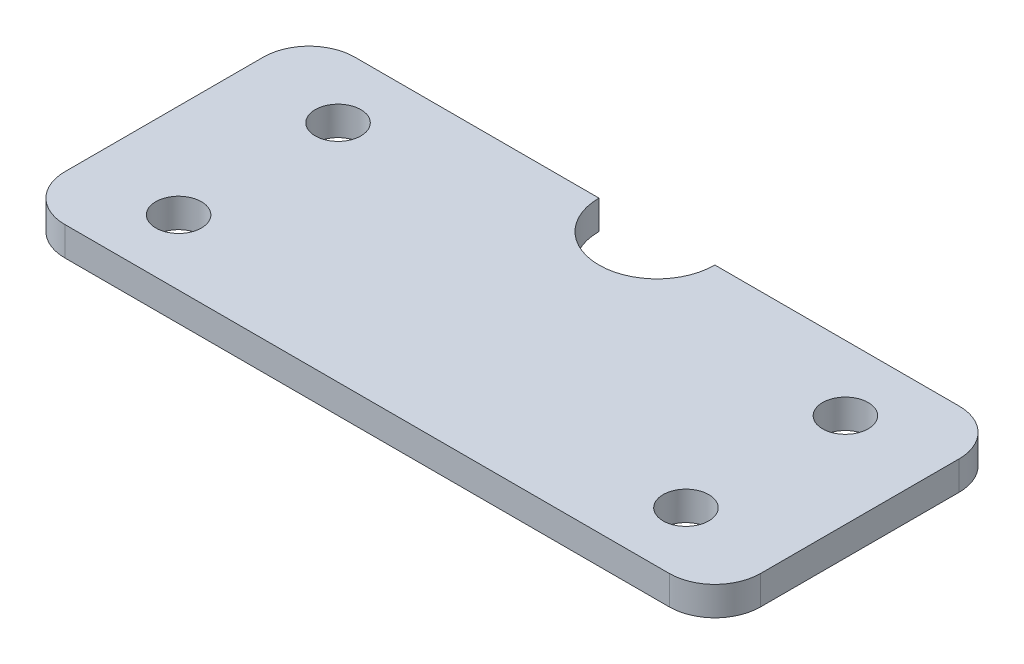
ISO-10303-21;
HEADER;
FILE_DESCRIPTION(('STEP AP214'),'2;1');
FILE_NAME('part.step','',(''),(''),'','','');
FILE_SCHEMA(('AUTOMOTIVE_DESIGN { 1 0 10303 214 1 1 1 1 }'));
ENDSEC;
DATA;
#1=APPLICATION_CONTEXT('core data for automotive mechanical design processes');
#2=APPLICATION_PROTOCOL_DEFINITION('international standard','automotive_design',2000,#1);
#3=PRODUCT_CONTEXT('',#1,'mechanical');
#4=PRODUCT('Part','Part','',(#3));
#5=PRODUCT_RELATED_PRODUCT_CATEGORY('part','',(#4));
#6=PRODUCT_DEFINITION_FORMATION('','',#4);
#7=PRODUCT_DEFINITION_CONTEXT('part definition',#1,'design');
#8=PRODUCT_DEFINITION('design','',#6,#7);
#9=PRODUCT_DEFINITION_SHAPE('','',#8);
#10=(LENGTH_UNIT() NAMED_UNIT(*) SI_UNIT(.MILLI.,.METRE.));
#11=(NAMED_UNIT(*) PLANE_ANGLE_UNIT() SI_UNIT($,.RADIAN.));
#12=(NAMED_UNIT(*) SI_UNIT($,.STERADIAN.) SOLID_ANGLE_UNIT());
#13=UNCERTAINTY_MEASURE_WITH_UNIT(LENGTH_MEASURE(1.E-05),#10,'distance_accuracy_value','');
#14=(GEOMETRIC_REPRESENTATION_CONTEXT(3) GLOBAL_UNCERTAINTY_ASSIGNED_CONTEXT((#13)) GLOBAL_UNIT_ASSIGNED_CONTEXT((#10,
#11,#12)) REPRESENTATION_CONTEXT('',''));
#15=CARTESIAN_POINT('',(0.,0.,0.));
#16=DIRECTION('',(0.,0.,1.));
#17=DIRECTION('',(1.,0.,0.));
#18=AXIS2_PLACEMENT_3D('',#15,#16,#17);
#19=CARTESIAN_POINT('',(-76.2,6.35,-31.75));
#20=DIRECTION('',(0.,0.,1.));
#21=DIRECTION('',(1.,0.,0.));
#22=AXIS2_PLACEMENT_3D('',#19,#20,#21);
#23=PLANE('',#22);
#24=DIRECTION('',(-1.,0.,0.));
#25=VECTOR('',#24,1.);
#26=CARTESIAN_POINT('',(-76.2,0.,-31.75));
#27=LINE('',#26,#25);
#28=CARTESIAN_POINT('',(66.2,0.,-31.75));
#29=VERTEX_POINT('',#28);
#30=CARTESIAN_POINT('',(12.6999999999999,0.,-31.75));
#31=VERTEX_POINT('',#30);
#32=EDGE_CURVE('E140',#29,#31,#27,.T.);
#33=ORIENTED_EDGE('',*,*,#32,.T.);
#34=DIRECTION('',(0.,1.,0.));
#35=VECTOR('',#34,1.);
#36=CARTESIAN_POINT('',(12.7,0.,-31.75));
#37=LINE('',#36,#35);
#38=CARTESIAN_POINT('',(12.7,6.35,-31.75));
#39=VERTEX_POINT('',#38);
#40=EDGE_CURVE('E57',#31,#39,#37,.T.);
#41=ORIENTED_EDGE('',*,*,#40,.T.);
#42=DIRECTION('',(-1.,0.,0.));
#43=VECTOR('',#42,1.);
#44=CARTESIAN_POINT('',(-76.2,6.35,-31.75));
#45=LINE('',#44,#43);
#46=CARTESIAN_POINT('',(66.2,6.35,-31.75));
#47=VERTEX_POINT('',#46);
#48=EDGE_CURVE('E230',#47,#39,#45,.T.);
#49=ORIENTED_EDGE('',*,*,#48,.F.);
#50=DIRECTION('',(0.,-1.,0.));
#51=VECTOR('',#50,1.);
#52=CARTESIAN_POINT('',(66.2,6.35,-31.75));
#53=LINE('',#52,#51);
#54=EDGE_CURVE('E11',#47,#29,#53,.T.);
#55=ORIENTED_EDGE('',*,*,#54,.T.);
#56=EDGE_LOOP('',(#33,#41,#49,#55));
#57=FACE_BOUND('',#56,.T.);
#58=ADVANCED_FACE('F39',(#57),#23,.F.);
#59=CARTESIAN_POINT('',(76.2,6.35,31.75));
#60=DIRECTION('',(-1.,0.,0.));
#61=DIRECTION('',(0.,0.,1.));
#62=AXIS2_PLACEMENT_3D('',#59,#60,#61);
#63=PLANE('',#62);
#64=DIRECTION('',(0.,0.,-1.));
#65=VECTOR('',#64,1.);
#66=CARTESIAN_POINT('',(76.2,6.35,31.75));
#67=LINE('',#66,#65);
#68=CARTESIAN_POINT('',(76.2,6.35,21.75));
#69=VERTEX_POINT('',#68);
#70=CARTESIAN_POINT('',(76.2,6.35,-21.75));
#71=VERTEX_POINT('',#70);
#72=EDGE_CURVE('E156',#69,#71,#67,.T.);
#73=ORIENTED_EDGE('',*,*,#72,.F.);
#74=DIRECTION('',(0.,-1.,0.));
#75=VECTOR('',#74,1.);
#76=CARTESIAN_POINT('',(76.2,6.35,21.75));
#77=LINE('',#76,#75);
#78=CARTESIAN_POINT('',(76.2,0.,21.75));
#79=VERTEX_POINT('',#78);
#80=EDGE_CURVE('E198',#69,#79,#77,.T.);
#81=ORIENTED_EDGE('',*,*,#80,.T.);
#82=DIRECTION('',(0.,0.,-1.));
#83=VECTOR('',#82,1.);
#84=CARTESIAN_POINT('',(76.2,0.,31.75));
#85=LINE('',#84,#83);
#86=CARTESIAN_POINT('',(76.2,0.,-21.75));
#87=VERTEX_POINT('',#86);
#88=EDGE_CURVE('E133',#79,#87,#85,.T.);
#89=ORIENTED_EDGE('',*,*,#88,.T.);
#90=DIRECTION('',(0.,-1.,0.));
#91=VECTOR('',#90,1.);
#92=CARTESIAN_POINT('',(76.2,6.35,-21.75));
#93=LINE('',#92,#91);
#94=EDGE_CURVE('E195',#87,#71,#93,.F.);
#95=ORIENTED_EDGE('',*,*,#94,.T.);
#96=EDGE_LOOP('',(#73,#81,#89,#95));
#97=FACE_BOUND('',#96,.T.);
#98=ADVANCED_FACE('F252',(#97),#63,.F.);
#99=CARTESIAN_POINT('',(-12.7,6.35,-31.75));
#100=VERTEX_POINT('',#99);
#101=CARTESIAN_POINT('',(-66.2,6.35,-31.75));
#102=VERTEX_POINT('',#101);
#103=EDGE_CURVE('E65',#100,#102,#45,.T.);
#104=ORIENTED_EDGE('',*,*,#103,.F.);
#105=DIRECTION('',(0.,1.,0.));
#106=VECTOR('',#105,1.);
#107=CARTESIAN_POINT('',(-12.7,0.,-31.75));
#108=LINE('',#107,#106);
#109=CARTESIAN_POINT('',(-12.7,0.,-31.75));
#110=VERTEX_POINT('',#109);
#111=EDGE_CURVE('E120',#110,#100,#108,.T.);
#112=ORIENTED_EDGE('',*,*,#111,.F.);
#113=CARTESIAN_POINT('',(-66.2,0.,-31.75));
#114=VERTEX_POINT('',#113);
#115=EDGE_CURVE('E130',#110,#114,#27,.T.);
#116=ORIENTED_EDGE('',*,*,#115,.T.);
#117=DIRECTION('',(0.,-1.,0.));
#118=VECTOR('',#117,1.);
#119=CARTESIAN_POINT('',(-66.2,6.35,-31.75));
#120=LINE('',#119,#118);
#121=EDGE_CURVE('E49',#114,#102,#120,.F.);
#122=ORIENTED_EDGE('',*,*,#121,.T.);
#123=EDGE_LOOP('',(#104,#112,#116,#122));
#124=FACE_BOUND('',#123,.T.);
#125=ADVANCED_FACE('F129',(#124),#23,.F.);
#126=CARTESIAN_POINT('',(-76.2,6.35,31.75));
#127=DIRECTION('',(1.,0.,0.));
#128=DIRECTION('',(0.,0.,-1.));
#129=AXIS2_PLACEMENT_3D('',#126,#127,#128);
#130=PLANE('',#129);
#131=DIRECTION('',(0.,0.,1.));
#132=VECTOR('',#131,1.);
#133=CARTESIAN_POINT('',(-76.2,0.,31.75));
#134=LINE('',#133,#132);
#135=CARTESIAN_POINT('',(-76.2,0.,-21.75));
#136=VERTEX_POINT('',#135);
#137=CARTESIAN_POINT('',(-76.2,0.,21.75));
#138=VERTEX_POINT('',#137);
#139=EDGE_CURVE('E144',#136,#138,#134,.T.);
#140=ORIENTED_EDGE('',*,*,#139,.T.);
#141=DIRECTION('',(0.,-1.,0.));
#142=VECTOR('',#141,1.);
#143=CARTESIAN_POINT('',(-76.2,6.35,21.75));
#144=LINE('',#143,#142);
#145=CARTESIAN_POINT('',(-76.2,6.35,21.75));
#146=VERTEX_POINT('',#145);
#147=EDGE_CURVE('E180',#138,#146,#144,.F.);
#148=ORIENTED_EDGE('',*,*,#147,.T.);
#149=DIRECTION('',(0.,0.,1.));
#150=VECTOR('',#149,1.);
#151=CARTESIAN_POINT('',(-76.2,6.35,31.75));
#152=LINE('',#151,#150);
#153=CARTESIAN_POINT('',(-76.2,6.35,-21.75));
#154=VERTEX_POINT('',#153);
#155=EDGE_CURVE('E234',#154,#146,#152,.T.);
#156=ORIENTED_EDGE('',*,*,#155,.F.);
#157=DIRECTION('',(0.,-1.,0.));
#158=VECTOR('',#157,1.);
#159=CARTESIAN_POINT('',(-76.2,6.35,-21.75));
#160=LINE('',#159,#158);
#161=EDGE_CURVE('E176',#154,#136,#160,.T.);
#162=ORIENTED_EDGE('',*,*,#161,.T.);
#163=EDGE_LOOP('',(#140,#148,#156,#162));
#164=FACE_BOUND('',#163,.T.);
#165=ADVANCED_FACE('F269',(#164),#130,.F.);
#166=CARTESIAN_POINT('',(-76.2,6.35,31.75));
#167=DIRECTION('',(0.,0.,-1.));
#168=DIRECTION('',(-1.,0.,0.));
#169=AXIS2_PLACEMENT_3D('',#166,#167,#168);
#170=PLANE('',#169);
#171=DIRECTION('',(1.,0.,0.));
#172=VECTOR('',#171,1.);
#173=CARTESIAN_POINT('',(-76.2,6.35,31.75));
#174=LINE('',#173,#172);
#175=CARTESIAN_POINT('',(-66.2,6.35,31.75));
#176=VERTEX_POINT('',#175);
#177=CARTESIAN_POINT('',(66.2,6.35,31.75));
#178=VERTEX_POINT('',#177);
#179=EDGE_CURVE('E161',#176,#178,#174,.T.);
#180=ORIENTED_EDGE('',*,*,#179,.F.);
#181=DIRECTION('',(0.,-1.,0.));
#182=VECTOR('',#181,1.);
#183=CARTESIAN_POINT('',(-66.2,6.35,31.75));
#184=LINE('',#183,#182);
#185=CARTESIAN_POINT('',(-66.2,0.,31.75));
#186=VERTEX_POINT('',#185);
#187=EDGE_CURVE('E160',#176,#186,#184,.T.);
#188=ORIENTED_EDGE('',*,*,#187,.T.);
#189=DIRECTION('',(1.,0.,0.));
#190=VECTOR('',#189,1.);
#191=CARTESIAN_POINT('',(-76.2,0.,31.75));
#192=LINE('',#191,#190);
#193=CARTESIAN_POINT('',(66.2,0.,31.75));
#194=VERTEX_POINT('',#193);
#195=EDGE_CURVE('E152',#186,#194,#192,.T.);
#196=ORIENTED_EDGE('',*,*,#195,.T.);
#197=DIRECTION('',(0.,-1.,0.));
#198=VECTOR('',#197,1.);
#199=CARTESIAN_POINT('',(66.2,6.35,31.75));
#200=LINE('',#199,#198);
#201=EDGE_CURVE('E157',#194,#178,#200,.F.);
#202=ORIENTED_EDGE('',*,*,#201,.T.);
#203=EDGE_LOOP('',(#180,#188,#196,#202));
#204=FACE_BOUND('',#203,.T.);
#205=ADVANCED_FACE('F273',(#204),#170,.F.);
#206=CARTESIAN_POINT('',(0.,6.35,0.));
#207=DIRECTION('',(0.,-1.,0.));
#208=DIRECTION('',(0.,0.,-1.));
#209=AXIS2_PLACEMENT_3D('',#206,#207,#208);
#210=PLANE('',#209);
#211=CARTESIAN_POINT('',(-55.5625,6.35,17.4625));
#212=DIRECTION('',(0.,1.,0.));
#213=DIRECTION('',(0.,0.,-1.));
#214=AXIS2_PLACEMENT_3D('',#211,#212,#213);
#215=CIRCLE('',#214,5.);
#216=CARTESIAN_POINT('',(-55.5625,6.35,12.4625));
#217=VERTEX_POINT('',#216);
#218=EDGE_CURVE('E317',#217,#217,#215,.T.);
#219=ORIENTED_EDGE('',*,*,#218,.F.);
#220=EDGE_LOOP('',(#219));
#221=FACE_BOUND('',#220,.T.);
#222=CARTESIAN_POINT('',(55.5625,6.35,17.4625));
#223=DIRECTION('',(0.,1.,0.));
#224=DIRECTION('',(0.,0.,1.));
#225=AXIS2_PLACEMENT_3D('',#222,#223,#224);
#226=CIRCLE('',#225,5.);
#227=CARTESIAN_POINT('',(55.5625,6.35,22.4625));
#228=VERTEX_POINT('',#227);
#229=EDGE_CURVE('E311',#228,#228,#226,.T.);
#230=ORIENTED_EDGE('',*,*,#229,.F.);
#231=EDGE_LOOP('',(#230));
#232=FACE_BOUND('',#231,.T.);
#233=CARTESIAN_POINT('',(55.5625,6.35,-17.4625));
#234=DIRECTION('',(0.,1.,0.));
#235=DIRECTION('',(0.,0.,-1.));
#236=AXIS2_PLACEMENT_3D('',#233,#234,#235);
#237=CIRCLE('',#236,5.);
#238=CARTESIAN_POINT('',(55.5625,6.35,-22.4625));
#239=VERTEX_POINT('',#238);
#240=EDGE_CURVE('E308',#239,#239,#237,.T.);
#241=ORIENTED_EDGE('',*,*,#240,.F.);
#242=EDGE_LOOP('',(#241));
#243=FACE_BOUND('',#242,.T.);
#244=CARTESIAN_POINT('',(-55.5625,6.35,-17.4625));
#245=DIRECTION('',(0.,1.,0.));
#246=DIRECTION('',(0.,0.,1.));
#247=AXIS2_PLACEMENT_3D('',#244,#245,#246);
#248=CIRCLE('',#247,5.);
#249=CARTESIAN_POINT('',(-55.5625,6.35,-12.4625));
#250=VERTEX_POINT('',#249);
#251=EDGE_CURVE('E209',#250,#250,#248,.T.);
#252=ORIENTED_EDGE('',*,*,#251,.F.);
#253=EDGE_LOOP('',(#252));
#254=FACE_BOUND('',#253,.T.);
#255=ORIENTED_EDGE('',*,*,#48,.T.);
#256=CARTESIAN_POINT('',(0.,6.35,-31.75));
#257=DIRECTION('',(0.,1.,0.));
#258=DIRECTION('',(0.,0.,-1.));
#259=AXIS2_PLACEMENT_3D('',#256,#257,#258);
#260=CIRCLE('',#259,12.7);
#261=EDGE_CURVE('E126',#100,#39,#260,.T.);
#262=ORIENTED_EDGE('',*,*,#261,.F.);
#263=ORIENTED_EDGE('',*,*,#103,.T.);
#264=CARTESIAN_POINT('',(-66.2,6.35,-21.75));
#265=DIRECTION('',(0.,-1.,0.));
#266=DIRECTION('',(0.,0.,-1.));
#267=AXIS2_PLACEMENT_3D('',#264,#265,#266);
#268=CIRCLE('',#267,10.);
#269=EDGE_CURVE('E183',#102,#154,#268,.F.);
#270=ORIENTED_EDGE('',*,*,#269,.T.);
#271=ORIENTED_EDGE('',*,*,#155,.T.);
#272=CARTESIAN_POINT('',(-66.2,6.35,21.75));
#273=DIRECTION('',(0.,-1.,0.));
#274=DIRECTION('',(0.,0.,-1.));
#275=AXIS2_PLACEMENT_3D('',#272,#273,#274);
#276=CIRCLE('',#275,10.);
#277=EDGE_CURVE('E192',#146,#176,#276,.F.);
#278=ORIENTED_EDGE('',*,*,#277,.T.);
#279=ORIENTED_EDGE('',*,*,#179,.T.);
#280=CARTESIAN_POINT('',(66.2,6.35,21.75));
#281=DIRECTION('',(0.,-1.,0.));
#282=DIRECTION('',(0.,0.,-1.));
#283=AXIS2_PLACEMENT_3D('',#280,#281,#282);
#284=CIRCLE('',#283,10.);
#285=EDGE_CURVE('E189',#178,#69,#284,.F.);
#286=ORIENTED_EDGE('',*,*,#285,.T.);
#287=ORIENTED_EDGE('',*,*,#72,.T.);
#288=CARTESIAN_POINT('',(66.2,6.35,-21.75));
#289=DIRECTION('',(0.,-1.,0.));
#290=DIRECTION('',(0.,0.,-1.));
#291=AXIS2_PLACEMENT_3D('',#288,#289,#290);
#292=CIRCLE('',#291,10.);
#293=EDGE_CURVE('E186',#71,#47,#292,.F.);
#294=ORIENTED_EDGE('',*,*,#293,.T.);
#295=EDGE_LOOP('',(#255,#262,#263,#270,#271,#278,#279,#286,#287,#294));
#296=FACE_BOUND('',#295,.T.);
#297=ADVANCED_FACE('F241',(#221,#232,#243,#254,#296),#210,.F.);
#298=CARTESIAN_POINT('',(0.,0.,0.));
#299=DIRECTION('',(0.,-1.,0.));
#300=DIRECTION('',(0.,0.,-1.));
#301=AXIS2_PLACEMENT_3D('',#298,#299,#300);
#302=PLANE('',#301);
#303=CARTESIAN_POINT('',(-55.5625,0.,17.4625));
#304=DIRECTION('',(0.,-1.,0.));
#305=DIRECTION('',(0.,0.,-1.));
#306=AXIS2_PLACEMENT_3D('',#303,#304,#305);
#307=CIRCLE('',#306,5.);
#308=CARTESIAN_POINT('',(-55.5625,0.,12.4625));
#309=VERTEX_POINT('',#308);
#310=EDGE_CURVE('E43',#309,#309,#307,.T.);
#311=ORIENTED_EDGE('',*,*,#310,.F.);
#312=EDGE_LOOP('',(#311));
#313=FACE_BOUND('',#312,.T.);
#314=CARTESIAN_POINT('',(55.5625,0.,17.4625));
#315=DIRECTION('',(0.,-1.,0.));
#316=DIRECTION('',(0.,0.,-1.));
#317=AXIS2_PLACEMENT_3D('',#314,#315,#316);
#318=CIRCLE('',#317,5.);
#319=CARTESIAN_POINT('',(55.5625,0.,12.4625));
#320=VERTEX_POINT('',#319);
#321=EDGE_CURVE('E212',#320,#320,#318,.T.);
#322=ORIENTED_EDGE('',*,*,#321,.F.);
#323=EDGE_LOOP('',(#322));
#324=FACE_BOUND('',#323,.T.);
#325=CARTESIAN_POINT('',(55.5625,0.,-17.4625));
#326=DIRECTION('',(0.,-1.,0.));
#327=DIRECTION('',(0.,0.,-1.));
#328=AXIS2_PLACEMENT_3D('',#325,#326,#327);
#329=CIRCLE('',#328,5.);
#330=CARTESIAN_POINT('',(55.5625,0.,-22.4625));
#331=VERTEX_POINT('',#330);
#332=EDGE_CURVE('E208',#331,#331,#329,.T.);
#333=ORIENTED_EDGE('',*,*,#332,.F.);
#334=EDGE_LOOP('',(#333));
#335=FACE_BOUND('',#334,.T.);
#336=CARTESIAN_POINT('',(-55.5625,0.,-17.4625));
#337=DIRECTION('',(0.,-1.,0.));
#338=DIRECTION('',(0.,0.,-1.));
#339=AXIS2_PLACEMENT_3D('',#336,#337,#338);
#340=CIRCLE('',#339,5.);
#341=CARTESIAN_POINT('',(-55.5625,0.,-22.4625));
#342=VERTEX_POINT('',#341);
#343=EDGE_CURVE('E204',#342,#342,#340,.T.);
#344=ORIENTED_EDGE('',*,*,#343,.F.);
#345=EDGE_LOOP('',(#344));
#346=FACE_BOUND('',#345,.T.);
#347=CARTESIAN_POINT('',(0.,0.,-31.75));
#348=DIRECTION('',(0.,1.,0.));
#349=DIRECTION('',(0.,0.,-1.));
#350=AXIS2_PLACEMENT_3D('',#347,#348,#349);
#351=CIRCLE('',#350,12.7);
#352=EDGE_CURVE('E117',#110,#31,#351,.T.);
#353=ORIENTED_EDGE('',*,*,#352,.T.);
#354=ORIENTED_EDGE('',*,*,#32,.F.);
#355=CARTESIAN_POINT('',(66.2,0.,-21.75));
#356=DIRECTION('',(0.,-1.,0.));
#357=DIRECTION('',(0.,0.,-1.));
#358=AXIS2_PLACEMENT_3D('',#355,#356,#357);
#359=CIRCLE('',#358,10.);
#360=EDGE_CURVE('E167',#29,#87,#359,.T.);
#361=ORIENTED_EDGE('',*,*,#360,.T.);
#362=ORIENTED_EDGE('',*,*,#88,.F.);
#363=CARTESIAN_POINT('',(66.2,0.,21.75));
#364=DIRECTION('',(0.,-1.,0.));
#365=DIRECTION('',(0.,0.,-1.));
#366=AXIS2_PLACEMENT_3D('',#363,#364,#365);
#367=CIRCLE('',#366,10.);
#368=EDGE_CURVE('E170',#79,#194,#367,.T.);
#369=ORIENTED_EDGE('',*,*,#368,.T.);
#370=ORIENTED_EDGE('',*,*,#195,.F.);
#371=CARTESIAN_POINT('',(-66.2,0.,21.75));
#372=DIRECTION('',(0.,-1.,0.));
#373=DIRECTION('',(0.,0.,-1.));
#374=AXIS2_PLACEMENT_3D('',#371,#372,#373);
#375=CIRCLE('',#374,10.);
#376=EDGE_CURVE('E173',#186,#138,#375,.T.);
#377=ORIENTED_EDGE('',*,*,#376,.T.);
#378=ORIENTED_EDGE('',*,*,#139,.F.);
#379=CARTESIAN_POINT('',(-66.2,0.,-21.75));
#380=DIRECTION('',(0.,-1.,0.));
#381=DIRECTION('',(0.,0.,-1.));
#382=AXIS2_PLACEMENT_3D('',#379,#380,#381);
#383=CIRCLE('',#382,10.);
#384=EDGE_CURVE('E137',#136,#114,#383,.T.);
#385=ORIENTED_EDGE('',*,*,#384,.T.);
#386=ORIENTED_EDGE('',*,*,#115,.F.);
#387=EDGE_LOOP('',(#353,#354,#361,#362,#369,#370,#377,#378,#385,#386));
#388=FACE_BOUND('',#387,.T.);
#389=ADVANCED_FACE('F135',(#313,#324,#335,#346,#388),#302,.T.);
#390=CARTESIAN_POINT('',(-66.2,6.35,21.75));
#391=DIRECTION('',(0.,-1.,0.));
#392=DIRECTION('',(0.,0.,-1.));
#393=AXIS2_PLACEMENT_3D('',#390,#391,#392);
#394=CYLINDRICAL_SURFACE('',#393,10.);
#395=ORIENTED_EDGE('',*,*,#277,.F.);
#396=ORIENTED_EDGE('',*,*,#147,.F.);
#397=ORIENTED_EDGE('',*,*,#376,.F.);
#398=ORIENTED_EDGE('',*,*,#187,.F.);
#399=EDGE_LOOP('',(#395,#396,#397,#398));
#400=FACE_BOUND('',#399,.T.);
#401=ADVANCED_FACE('F282',(#400),#394,.T.);
#402=CARTESIAN_POINT('',(66.2,6.35,21.75));
#403=DIRECTION('',(0.,-1.,0.));
#404=DIRECTION('',(0.,0.,-1.));
#405=AXIS2_PLACEMENT_3D('',#402,#403,#404);
#406=CYLINDRICAL_SURFACE('',#405,10.);
#407=ORIENTED_EDGE('',*,*,#285,.F.);
#408=ORIENTED_EDGE('',*,*,#201,.F.);
#409=ORIENTED_EDGE('',*,*,#368,.F.);
#410=ORIENTED_EDGE('',*,*,#80,.F.);
#411=EDGE_LOOP('',(#407,#408,#409,#410));
#412=FACE_BOUND('',#411,.T.);
#413=ADVANCED_FACE('F249',(#412),#406,.T.);
#414=CARTESIAN_POINT('',(66.2,6.35,-21.75));
#415=DIRECTION('',(0.,-1.,0.));
#416=DIRECTION('',(0.,0.,-1.));
#417=AXIS2_PLACEMENT_3D('',#414,#415,#416);
#418=CYLINDRICAL_SURFACE('',#417,10.);
#419=ORIENTED_EDGE('',*,*,#293,.F.);
#420=ORIENTED_EDGE('',*,*,#94,.F.);
#421=ORIENTED_EDGE('',*,*,#360,.F.);
#422=ORIENTED_EDGE('',*,*,#54,.F.);
#423=EDGE_LOOP('',(#419,#420,#421,#422));
#424=FACE_BOUND('',#423,.T.);
#425=ADVANCED_FACE('F258',(#424),#418,.T.);
#426=CARTESIAN_POINT('',(-66.2,6.35,-21.75));
#427=DIRECTION('',(0.,-1.,0.));
#428=DIRECTION('',(0.,0.,-1.));
#429=AXIS2_PLACEMENT_3D('',#426,#427,#428);
#430=CYLINDRICAL_SURFACE('',#429,10.);
#431=ORIENTED_EDGE('',*,*,#269,.F.);
#432=ORIENTED_EDGE('',*,*,#121,.F.);
#433=ORIENTED_EDGE('',*,*,#384,.F.);
#434=ORIENTED_EDGE('',*,*,#161,.F.);
#435=EDGE_LOOP('',(#431,#432,#433,#434));
#436=FACE_BOUND('',#435,.T.);
#437=ADVANCED_FACE('F41',(#436),#430,.T.);
#438=CARTESIAN_POINT('',(0.,0.,-31.75));
#439=DIRECTION('',(0.,1.,0.));
#440=DIRECTION('',(0.,0.,1.));
#441=AXIS2_PLACEMENT_3D('',#438,#439,#440);
#442=CYLINDRICAL_SURFACE('',#441,12.7);
#443=ORIENTED_EDGE('',*,*,#261,.T.);
#444=ORIENTED_EDGE('',*,*,#40,.F.);
#445=ORIENTED_EDGE('',*,*,#352,.F.);
#446=ORIENTED_EDGE('',*,*,#111,.T.);
#447=EDGE_LOOP('',(#443,#444,#445,#446));
#448=FACE_BOUND('',#447,.T.);
#449=ADVANCED_FACE('F119',(#448),#442,.F.);
#450=CARTESIAN_POINT('',(-55.5625,-3.65,-17.4625));
#451=DIRECTION('',(0.,1.,0.));
#452=DIRECTION('',(0.,0.,1.));
#453=AXIS2_PLACEMENT_3D('',#450,#451,#452);
#454=CYLINDRICAL_SURFACE('',#453,5.);
#455=ORIENTED_EDGE('',*,*,#343,.T.);
#456=EDGE_LOOP('',(#455));
#457=FACE_BOUND('',#456,.T.);
#458=ORIENTED_EDGE('',*,*,#251,.T.);
#459=EDGE_LOOP('',(#458));
#460=FACE_BOUND('',#459,.T.);
#461=ADVANCED_FACE('F289',(#457,#460),#454,.F.);
#462=CARTESIAN_POINT('',(55.5625,-3.65,-17.4625));
#463=DIRECTION('',(0.,1.,0.));
#464=DIRECTION('',(0.,0.,1.));
#465=AXIS2_PLACEMENT_3D('',#462,#463,#464);
#466=CYLINDRICAL_SURFACE('',#465,5.);
#467=ORIENTED_EDGE('',*,*,#332,.T.);
#468=EDGE_LOOP('',(#467));
#469=FACE_BOUND('',#468,.T.);
#470=ORIENTED_EDGE('',*,*,#240,.T.);
#471=EDGE_LOOP('',(#470));
#472=FACE_BOUND('',#471,.T.);
#473=ADVANCED_FACE('F292',(#469,#472),#466,.F.);
#474=CARTESIAN_POINT('',(55.5625,-3.65,17.4625));
#475=DIRECTION('',(0.,1.,0.));
#476=DIRECTION('',(0.,0.,1.));
#477=AXIS2_PLACEMENT_3D('',#474,#475,#476);
#478=CYLINDRICAL_SURFACE('',#477,5.);
#479=ORIENTED_EDGE('',*,*,#321,.T.);
#480=EDGE_LOOP('',(#479));
#481=FACE_BOUND('',#480,.T.);
#482=ORIENTED_EDGE('',*,*,#229,.T.);
#483=EDGE_LOOP('',(#482));
#484=FACE_BOUND('',#483,.T.);
#485=ADVANCED_FACE('F297',(#481,#484),#478,.F.);
#486=CARTESIAN_POINT('',(-55.5625,-3.65,17.4625));
#487=DIRECTION('',(0.,1.,0.));
#488=DIRECTION('',(0.,0.,1.));
#489=AXIS2_PLACEMENT_3D('',#486,#487,#488);
#490=CYLINDRICAL_SURFACE('',#489,5.);
#491=ORIENTED_EDGE('',*,*,#310,.T.);
#492=EDGE_LOOP('',(#491));
#493=FACE_BOUND('',#492,.T.);
#494=ORIENTED_EDGE('',*,*,#218,.T.);
#495=EDGE_LOOP('',(#494));
#496=FACE_BOUND('',#495,.T.);
#497=ADVANCED_FACE('F294',(#493,#496),#490,.F.);
#498=CLOSED_SHELL('',(#58,#98,#125,#165,#205,#297,#389,#401,#413,#425,#437,#449,#461,#473,#485,#497));
#499=MANIFOLD_SOLID_BREP('B2',#498);
#500=ADVANCED_BREP_SHAPE_REPRESENTATION('',(#18,#499),#14);
#501=SHAPE_DEFINITION_REPRESENTATION(#9,#500);
ENDSEC;
END-ISO-10303-21;
